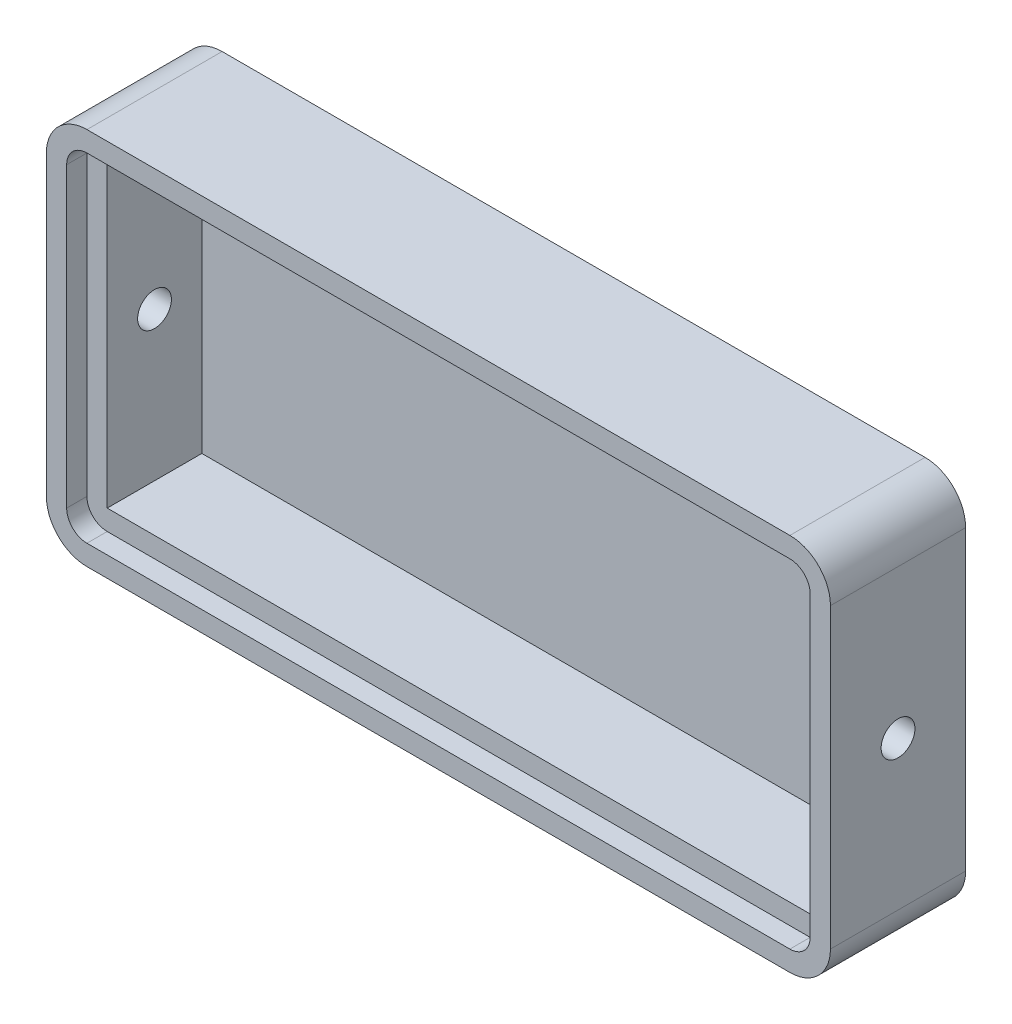
ISO-10303-21;
HEADER;
FILE_DESCRIPTION(('STEP AP214'),'2;1');
FILE_NAME('part.step','',(''),(''),'','','');
FILE_SCHEMA(('AUTOMOTIVE_DESIGN { 1 0 10303 214 1 1 1 1 }'));
ENDSEC;
DATA;
#1=APPLICATION_CONTEXT('core data for automotive mechanical design processes');
#2=APPLICATION_PROTOCOL_DEFINITION('international standard','automotive_design',2000,#1);
#3=PRODUCT_CONTEXT('',#1,'mechanical');
#4=PRODUCT('Part','Part','',(#3));
#5=PRODUCT_RELATED_PRODUCT_CATEGORY('part','',(#4));
#6=PRODUCT_DEFINITION_FORMATION('','',#4);
#7=PRODUCT_DEFINITION_CONTEXT('part definition',#1,'design');
#8=PRODUCT_DEFINITION('design','',#6,#7);
#9=PRODUCT_DEFINITION_SHAPE('','',#8);
#10=(LENGTH_UNIT() NAMED_UNIT(*) SI_UNIT(.MILLI.,.METRE.));
#11=(NAMED_UNIT(*) PLANE_ANGLE_UNIT() SI_UNIT($,.RADIAN.));
#12=(NAMED_UNIT(*) SI_UNIT($,.STERADIAN.) SOLID_ANGLE_UNIT());
#13=UNCERTAINTY_MEASURE_WITH_UNIT(LENGTH_MEASURE(1.E-05),#10,'distance_accuracy_value','');
#14=(GEOMETRIC_REPRESENTATION_CONTEXT(3) GLOBAL_UNCERTAINTY_ASSIGNED_CONTEXT((#13)) GLOBAL_UNIT_ASSIGNED_CONTEXT((#10,
#11,#12)) REPRESENTATION_CONTEXT('',''));
#15=CARTESIAN_POINT('',(0.,0.,0.));
#16=DIRECTION('',(0.,0.,1.));
#17=DIRECTION('',(1.,0.,0.));
#18=AXIS2_PLACEMENT_3D('',#15,#16,#17);
#19=CARTESIAN_POINT('',(58.,28.,20.));
#20=DIRECTION('',(-1.,0.,0.));
#21=DIRECTION('',(0.,-1.,0.));
#22=AXIS2_PLACEMENT_3D('',#19,#20,#21);
#23=PLANE('',#22);
#24=CARTESIAN_POINT('',(58.,0.,10.));
#25=DIRECTION('',(-1.,0.,0.));
#26=DIRECTION('',(0.,0.,1.));
#27=AXIS2_PLACEMENT_3D('',#24,#25,#26);
#28=CIRCLE('',#27,2.5);
#29=CARTESIAN_POINT('',(58.,0.,12.5));
#30=VERTEX_POINT('',#29);
#31=EDGE_CURVE('E375',#30,#30,#28,.T.);
#32=ORIENTED_EDGE('',*,*,#31,.T.);
#33=EDGE_LOOP('',(#32));
#34=FACE_BOUND('',#33,.T.);
#35=DIRECTION('',(0.,1.,0.));
#36=VECTOR('',#35,1.);
#37=CARTESIAN_POINT('',(58.,28.,0.));
#38=LINE('',#37,#36);
#39=CARTESIAN_POINT('',(58.,-22.,0.));
#40=VERTEX_POINT('',#39);
#41=CARTESIAN_POINT('',(58.,22.,0.));
#42=VERTEX_POINT('',#41);
#43=EDGE_CURVE('E220',#40,#42,#38,.T.);
#44=ORIENTED_EDGE('',*,*,#43,.T.);
#45=DIRECTION('',(0.,0.,-1.));
#46=VECTOR('',#45,1.);
#47=CARTESIAN_POINT('',(58.,22.,20.));
#48=LINE('',#47,#46);
#49=CARTESIAN_POINT('',(58.,22.,20.));
#50=VERTEX_POINT('',#49);
#51=EDGE_CURVE('E284',#42,#50,#48,.F.);
#52=ORIENTED_EDGE('',*,*,#51,.T.);
#53=DIRECTION('',(0.,1.,0.));
#54=VECTOR('',#53,1.);
#55=CARTESIAN_POINT('',(58.,28.,20.));
#56=LINE('',#55,#54);
#57=CARTESIAN_POINT('',(58.,-22.,20.));
#58=VERTEX_POINT('',#57);
#59=EDGE_CURVE('E245',#58,#50,#56,.T.);
#60=ORIENTED_EDGE('',*,*,#59,.F.);
#61=DIRECTION('',(0.,0.,-1.));
#62=VECTOR('',#61,1.);
#63=CARTESIAN_POINT('',(58.,-22.,20.));
#64=LINE('',#63,#62);
#65=EDGE_CURVE('E281',#58,#40,#64,.T.);
#66=ORIENTED_EDGE('',*,*,#65,.T.);
#67=EDGE_LOOP('',(#44,#52,#60,#66));
#68=FACE_BOUND('',#67,.T.);
#69=ADVANCED_FACE('F35',(#34,#68),#23,.F.);
#70=CARTESIAN_POINT('',(-58.,28.,20.));
#71=DIRECTION('',(0.,-1.,0.));
#72=DIRECTION('',(0.,0.,-1.));
#73=AXIS2_PLACEMENT_3D('',#70,#71,#72);
#74=PLANE('',#73);
#75=DIRECTION('',(-1.,0.,0.));
#76=VECTOR('',#75,1.);
#77=CARTESIAN_POINT('',(-58.,28.,20.));
#78=LINE('',#77,#76);
#79=CARTESIAN_POINT('',(52.,28.,20.));
#80=VERTEX_POINT('',#79);
#81=CARTESIAN_POINT('',(-52.,28.,20.));
#82=VERTEX_POINT('',#81);
#83=EDGE_CURVE('E248',#80,#82,#78,.T.);
#84=ORIENTED_EDGE('',*,*,#83,.F.);
#85=DIRECTION('',(0.,0.,-1.));
#86=VECTOR('',#85,1.);
#87=CARTESIAN_POINT('',(52.,28.,20.));
#88=LINE('',#87,#86);
#89=CARTESIAN_POINT('',(52.,28.,0.));
#90=VERTEX_POINT('',#89);
#91=EDGE_CURVE('E270',#80,#90,#88,.T.);
#92=ORIENTED_EDGE('',*,*,#91,.T.);
#93=DIRECTION('',(-1.,0.,0.));
#94=VECTOR('',#93,1.);
#95=CARTESIAN_POINT('',(-58.,28.,0.));
#96=LINE('',#95,#94);
#97=CARTESIAN_POINT('',(-52.,28.,0.));
#98=VERTEX_POINT('',#97);
#99=EDGE_CURVE('E261',#90,#98,#96,.T.);
#100=ORIENTED_EDGE('',*,*,#99,.T.);
#101=DIRECTION('',(0.,0.,-1.));
#102=VECTOR('',#101,1.);
#103=CARTESIAN_POINT('',(-52.,28.,20.));
#104=LINE('',#103,#102);
#105=EDGE_CURVE('E258',#98,#82,#104,.F.);
#106=ORIENTED_EDGE('',*,*,#105,.T.);
#107=EDGE_LOOP('',(#84,#92,#100,#106));
#108=FACE_BOUND('',#107,.T.);
#109=ADVANCED_FACE('F333',(#108),#74,.F.);
#110=CARTESIAN_POINT('',(-58.,28.,20.));
#111=DIRECTION('',(1.,0.,0.));
#112=DIRECTION('',(0.,0.,-1.));
#113=AXIS2_PLACEMENT_3D('',#110,#111,#112);
#114=PLANE('',#113);
#115=CARTESIAN_POINT('',(-58.,0.,10.));
#116=DIRECTION('',(-1.,0.,0.));
#117=DIRECTION('',(0.,0.,1.));
#118=AXIS2_PLACEMENT_3D('',#115,#116,#117);
#119=CIRCLE('',#118,2.5);
#120=CARTESIAN_POINT('',(-58.,0.,12.5));
#121=VERTEX_POINT('',#120);
#122=EDGE_CURVE('E373',#121,#121,#119,.T.);
#123=ORIENTED_EDGE('',*,*,#122,.F.);
#124=EDGE_LOOP('',(#123));
#125=FACE_BOUND('',#124,.T.);
#126=DIRECTION('',(0.,-1.,0.));
#127=VECTOR('',#126,1.);
#128=CARTESIAN_POINT('',(-58.,28.,20.));
#129=LINE('',#128,#127);
#130=CARTESIAN_POINT('',(-58.,22.,20.));
#131=VERTEX_POINT('',#130);
#132=CARTESIAN_POINT('',(-58.,-22.,20.));
#133=VERTEX_POINT('',#132);
#134=EDGE_CURVE('E252',#131,#133,#129,.T.);
#135=ORIENTED_EDGE('',*,*,#134,.F.);
#136=DIRECTION('',(0.,0.,-1.));
#137=VECTOR('',#136,1.);
#138=CARTESIAN_POINT('',(-58.,22.,20.));
#139=LINE('',#138,#137);
#140=CARTESIAN_POINT('',(-58.,22.,0.));
#141=VERTEX_POINT('',#140);
#142=EDGE_CURVE('E12',#131,#141,#139,.T.);
#143=ORIENTED_EDGE('',*,*,#142,.T.);
#144=DIRECTION('',(0.,-1.,0.));
#145=VECTOR('',#144,1.);
#146=CARTESIAN_POINT('',(-58.,28.,0.));
#147=LINE('',#146,#145);
#148=CARTESIAN_POINT('',(-58.,-22.,0.));
#149=VERTEX_POINT('',#148);
#150=EDGE_CURVE('E264',#141,#149,#147,.T.);
#151=ORIENTED_EDGE('',*,*,#150,.T.);
#152=DIRECTION('',(0.,0.,-1.));
#153=VECTOR('',#152,1.);
#154=CARTESIAN_POINT('',(-58.,-22.,20.));
#155=LINE('',#154,#153);
#156=EDGE_CURVE('E44',#149,#133,#155,.F.);
#157=ORIENTED_EDGE('',*,*,#156,.T.);
#158=EDGE_LOOP('',(#135,#143,#151,#157));
#159=FACE_BOUND('',#158,.T.);
#160=ADVANCED_FACE('F302',(#125,#159),#114,.F.);
#161=CARTESIAN_POINT('',(-58.,-28.,20.));
#162=DIRECTION('',(0.,1.,0.));
#163=DIRECTION('',(0.,0.,1.));
#164=AXIS2_PLACEMENT_3D('',#161,#162,#163);
#165=PLANE('',#164);
#166=DIRECTION('',(1.,0.,0.));
#167=VECTOR('',#166,1.);
#168=CARTESIAN_POINT('',(-58.,-28.,0.));
#169=LINE('',#168,#167);
#170=CARTESIAN_POINT('',(-52.,-28.,0.));
#171=VERTEX_POINT('',#170);
#172=CARTESIAN_POINT('',(52.,-28.,0.));
#173=VERTEX_POINT('',#172);
#174=EDGE_CURVE('E249',#171,#173,#169,.T.);
#175=ORIENTED_EDGE('',*,*,#174,.T.);
#176=DIRECTION('',(0.,0.,-1.));
#177=VECTOR('',#176,1.);
#178=CARTESIAN_POINT('',(52.,-28.,20.));
#179=LINE('',#178,#177);
#180=CARTESIAN_POINT('',(52.,-28.,20.));
#181=VERTEX_POINT('',#180);
#182=EDGE_CURVE('E297',#173,#181,#179,.F.);
#183=ORIENTED_EDGE('',*,*,#182,.T.);
#184=DIRECTION('',(1.,0.,0.));
#185=VECTOR('',#184,1.);
#186=CARTESIAN_POINT('',(-58.,-28.,20.));
#187=LINE('',#186,#185);
#188=CARTESIAN_POINT('',(-52.,-28.,20.));
#189=VERTEX_POINT('',#188);
#190=EDGE_CURVE('E255',#189,#181,#187,.T.);
#191=ORIENTED_EDGE('',*,*,#190,.F.);
#192=DIRECTION('',(0.,0.,-1.));
#193=VECTOR('',#192,1.);
#194=CARTESIAN_POINT('',(-52.,-28.,20.));
#195=LINE('',#194,#193);
#196=EDGE_CURVE('E294',#189,#171,#195,.T.);
#197=ORIENTED_EDGE('',*,*,#196,.T.);
#198=EDGE_LOOP('',(#175,#183,#191,#197));
#199=FACE_BOUND('',#198,.T.);
#200=ADVANCED_FACE('F314',(#199),#165,.F.);
#201=CARTESIAN_POINT('',(0.,0.,20.));
#202=DIRECTION('',(0.,0.,1.));
#203=DIRECTION('',(1.,0.,0.));
#204=AXIS2_PLACEMENT_3D('',#201,#202,#203);
#205=PLANE('',#204);
#206=DIRECTION('',(0.,1.,0.));
#207=VECTOR('',#206,1.);
#208=CARTESIAN_POINT('',(55.,28.,20.));
#209=LINE('',#208,#207);
#210=CARTESIAN_POINT('',(55.,-22.,20.));
#211=VERTEX_POINT('',#210);
#212=CARTESIAN_POINT('',(55.,22.,20.));
#213=VERTEX_POINT('',#212);
#214=EDGE_CURVE('E183',#211,#213,#209,.T.);
#215=ORIENTED_EDGE('',*,*,#214,.F.);
#216=CARTESIAN_POINT('',(52.,-22.,20.));
#217=DIRECTION('',(0.,0.,1.));
#218=DIRECTION('',(1.,0.,0.));
#219=AXIS2_PLACEMENT_3D('',#216,#217,#218);
#220=CIRCLE('',#219,3.);
#221=CARTESIAN_POINT('',(52.,-25.,20.));
#222=VERTEX_POINT('',#221);
#223=EDGE_CURVE('E233',#222,#211,#220,.T.);
#224=ORIENTED_EDGE('',*,*,#223,.F.);
#225=DIRECTION('',(1.,0.,0.));
#226=VECTOR('',#225,1.);
#227=CARTESIAN_POINT('',(-58.,-25.,20.));
#228=LINE('',#227,#226);
#229=CARTESIAN_POINT('',(-52.,-25.,20.));
#230=VERTEX_POINT('',#229);
#231=EDGE_CURVE('E216',#230,#222,#228,.T.);
#232=ORIENTED_EDGE('',*,*,#231,.F.);
#233=CARTESIAN_POINT('',(-52.,-22.,20.));
#234=DIRECTION('',(0.,0.,1.));
#235=DIRECTION('',(1.,0.,0.));
#236=AXIS2_PLACEMENT_3D('',#233,#234,#235);
#237=CIRCLE('',#236,3.);
#238=CARTESIAN_POINT('',(-55.,-22.,20.));
#239=VERTEX_POINT('',#238);
#240=EDGE_CURVE('E207',#239,#230,#237,.T.);
#241=ORIENTED_EDGE('',*,*,#240,.F.);
#242=DIRECTION('',(0.,-1.,0.));
#243=VECTOR('',#242,1.);
#244=CARTESIAN_POINT('',(-55.,28.,20.));
#245=LINE('',#244,#243);
#246=CARTESIAN_POINT('',(-55.,22.,20.));
#247=VERTEX_POINT('',#246);
#248=EDGE_CURVE('E236',#247,#239,#245,.T.);
#249=ORIENTED_EDGE('',*,*,#248,.F.);
#250=CARTESIAN_POINT('',(-52.,22.,20.));
#251=DIRECTION('',(0.,0.,1.));
#252=DIRECTION('',(1.,0.,0.));
#253=AXIS2_PLACEMENT_3D('',#250,#251,#252);
#254=CIRCLE('',#253,3.);
#255=CARTESIAN_POINT('',(-52.,25.,20.));
#256=VERTEX_POINT('',#255);
#257=EDGE_CURVE('E237',#256,#247,#254,.T.);
#258=ORIENTED_EDGE('',*,*,#257,.F.);
#259=DIRECTION('',(-1.,0.,0.));
#260=VECTOR('',#259,1.);
#261=CARTESIAN_POINT('',(-58.,25.,20.));
#262=LINE('',#261,#260);
#263=CARTESIAN_POINT('',(52.,25.,20.));
#264=VERTEX_POINT('',#263);
#265=EDGE_CURVE('E231',#264,#256,#262,.T.);
#266=ORIENTED_EDGE('',*,*,#265,.F.);
#267=CARTESIAN_POINT('',(52.,22.,20.));
#268=DIRECTION('',(0.,0.,1.));
#269=DIRECTION('',(1.,0.,0.));
#270=AXIS2_PLACEMENT_3D('',#267,#268,#269);
#271=CIRCLE('',#270,3.);
#272=EDGE_CURVE('E227',#213,#264,#271,.T.);
#273=ORIENTED_EDGE('',*,*,#272,.F.);
#274=EDGE_LOOP('',(#215,#224,#232,#241,#249,#258,#266,#273));
#275=FACE_BOUND('',#274,.T.);
#276=ORIENTED_EDGE('',*,*,#59,.T.);
#277=CARTESIAN_POINT('',(52.,22.,20.));
#278=DIRECTION('',(0.,0.,1.));
#279=DIRECTION('',(1.,0.,0.));
#280=AXIS2_PLACEMENT_3D('',#277,#278,#279);
#281=CIRCLE('',#280,6.);
#282=EDGE_CURVE('E292',#50,#80,#281,.T.);
#283=ORIENTED_EDGE('',*,*,#282,.T.);
#284=ORIENTED_EDGE('',*,*,#83,.T.);
#285=CARTESIAN_POINT('',(-52.,22.,20.));
#286=DIRECTION('',(0.,0.,1.));
#287=DIRECTION('',(1.,0.,0.));
#288=AXIS2_PLACEMENT_3D('',#285,#286,#287);
#289=CIRCLE('',#288,6.);
#290=EDGE_CURVE('E288',#82,#131,#289,.T.);
#291=ORIENTED_EDGE('',*,*,#290,.T.);
#292=ORIENTED_EDGE('',*,*,#134,.T.);
#293=CARTESIAN_POINT('',(-52.,-22.,20.));
#294=DIRECTION('',(0.,0.,1.));
#295=DIRECTION('',(1.,0.,0.));
#296=AXIS2_PLACEMENT_3D('',#293,#294,#295);
#297=CIRCLE('',#296,6.);
#298=EDGE_CURVE('E286',#133,#189,#297,.T.);
#299=ORIENTED_EDGE('',*,*,#298,.T.);
#300=ORIENTED_EDGE('',*,*,#190,.T.);
#301=CARTESIAN_POINT('',(52.,-22.,20.));
#302=DIRECTION('',(0.,0.,1.));
#303=DIRECTION('',(1.,0.,0.));
#304=AXIS2_PLACEMENT_3D('',#301,#302,#303);
#305=CIRCLE('',#304,6.);
#306=EDGE_CURVE('E290',#181,#58,#305,.T.);
#307=ORIENTED_EDGE('',*,*,#306,.T.);
#308=EDGE_LOOP('',(#276,#283,#284,#291,#292,#299,#300,#307));
#309=FACE_BOUND('',#308,.T.);
#310=ADVANCED_FACE('F308',(#275,#309),#205,.T.);
#311=CARTESIAN_POINT('',(0.,0.,0.));
#312=DIRECTION('',(0.,0.,1.));
#313=DIRECTION('',(1.,0.,0.));
#314=AXIS2_PLACEMENT_3D('',#311,#312,#313);
#315=PLANE('',#314);
#316=ORIENTED_EDGE('',*,*,#99,.F.);
#317=CARTESIAN_POINT('',(52.,22.,0.));
#318=DIRECTION('',(0.,0.,1.));
#319=DIRECTION('',(1.,0.,0.));
#320=AXIS2_PLACEMENT_3D('',#317,#318,#319);
#321=CIRCLE('',#320,6.);
#322=EDGE_CURVE('E279',#90,#42,#321,.F.);
#323=ORIENTED_EDGE('',*,*,#322,.T.);
#324=ORIENTED_EDGE('',*,*,#43,.F.);
#325=CARTESIAN_POINT('',(52.,-22.,0.));
#326=DIRECTION('',(0.,0.,1.));
#327=DIRECTION('',(1.,0.,0.));
#328=AXIS2_PLACEMENT_3D('',#325,#326,#327);
#329=CIRCLE('',#328,6.);
#330=EDGE_CURVE('E277',#40,#173,#329,.F.);
#331=ORIENTED_EDGE('',*,*,#330,.T.);
#332=ORIENTED_EDGE('',*,*,#174,.F.);
#333=CARTESIAN_POINT('',(-52.,-22.,0.));
#334=DIRECTION('',(0.,0.,1.));
#335=DIRECTION('',(1.,0.,0.));
#336=AXIS2_PLACEMENT_3D('',#333,#334,#335);
#337=CIRCLE('',#336,6.);
#338=EDGE_CURVE('E273',#171,#149,#337,.F.);
#339=ORIENTED_EDGE('',*,*,#338,.T.);
#340=ORIENTED_EDGE('',*,*,#150,.F.);
#341=CARTESIAN_POINT('',(-52.,22.,0.));
#342=DIRECTION('',(0.,0.,1.));
#343=DIRECTION('',(1.,0.,0.));
#344=AXIS2_PLACEMENT_3D('',#341,#342,#343);
#345=CIRCLE('',#344,6.);
#346=EDGE_CURVE('E275',#141,#98,#345,.F.);
#347=ORIENTED_EDGE('',*,*,#346,.T.);
#348=EDGE_LOOP('',(#316,#323,#324,#331,#332,#339,#340,#347));
#349=FACE_BOUND('',#348,.T.);
#350=ADVANCED_FACE('F318',(#349),#315,.F.);
#351=CARTESIAN_POINT('',(52.,22.,20.));
#352=DIRECTION('',(0.,0.,-1.));
#353=DIRECTION('',(-1.,0.,0.));
#354=AXIS2_PLACEMENT_3D('',#351,#352,#353);
#355=CYLINDRICAL_SURFACE('',#354,6.);
#356=ORIENTED_EDGE('',*,*,#282,.F.);
#357=ORIENTED_EDGE('',*,*,#51,.F.);
#358=ORIENTED_EDGE('',*,*,#322,.F.);
#359=ORIENTED_EDGE('',*,*,#91,.F.);
#360=EDGE_LOOP('',(#356,#357,#358,#359));
#361=FACE_BOUND('',#360,.T.);
#362=ADVANCED_FACE('F331',(#361),#355,.T.);
#363=CARTESIAN_POINT('',(52.,-22.,20.));
#364=DIRECTION('',(0.,0.,-1.));
#365=DIRECTION('',(-1.,0.,0.));
#366=AXIS2_PLACEMENT_3D('',#363,#364,#365);
#367=CYLINDRICAL_SURFACE('',#366,6.);
#368=ORIENTED_EDGE('',*,*,#306,.F.);
#369=ORIENTED_EDGE('',*,*,#182,.F.);
#370=ORIENTED_EDGE('',*,*,#330,.F.);
#371=ORIENTED_EDGE('',*,*,#65,.F.);
#372=EDGE_LOOP('',(#368,#369,#370,#371));
#373=FACE_BOUND('',#372,.T.);
#374=ADVANCED_FACE('F323',(#373),#367,.T.);
#375=CARTESIAN_POINT('',(-52.,22.,20.));
#376=DIRECTION('',(0.,0.,-1.));
#377=DIRECTION('',(-1.,0.,0.));
#378=AXIS2_PLACEMENT_3D('',#375,#376,#377);
#379=CYLINDRICAL_SURFACE('',#378,6.);
#380=ORIENTED_EDGE('',*,*,#290,.F.);
#381=ORIENTED_EDGE('',*,*,#105,.F.);
#382=ORIENTED_EDGE('',*,*,#346,.F.);
#383=ORIENTED_EDGE('',*,*,#142,.F.);
#384=EDGE_LOOP('',(#380,#381,#382,#383));
#385=FACE_BOUND('',#384,.T.);
#386=ADVANCED_FACE('F336',(#385),#379,.T.);
#387=CARTESIAN_POINT('',(-52.,-22.,20.));
#388=DIRECTION('',(0.,0.,-1.));
#389=DIRECTION('',(-1.,0.,0.));
#390=AXIS2_PLACEMENT_3D('',#387,#388,#389);
#391=CYLINDRICAL_SURFACE('',#390,6.);
#392=ORIENTED_EDGE('',*,*,#298,.F.);
#393=ORIENTED_EDGE('',*,*,#156,.F.);
#394=ORIENTED_EDGE('',*,*,#338,.F.);
#395=ORIENTED_EDGE('',*,*,#196,.F.);
#396=EDGE_LOOP('',(#392,#393,#394,#395));
#397=FACE_BOUND('',#396,.T.);
#398=ADVANCED_FACE('F37',(#397),#391,.T.);
#399=CARTESIAN_POINT('',(55.,28.,20.));
#400=DIRECTION('',(-1.,0.,0.));
#401=DIRECTION('',(0.,-1.,0.));
#402=AXIS2_PLACEMENT_3D('',#399,#400,#401);
#403=PLANE('',#402);
#404=DIRECTION('',(0.,1.,0.));
#405=VECTOR('',#404,1.);
#406=CARTESIAN_POINT('',(55.,-22.,17.));
#407=LINE('',#406,#405);
#408=CARTESIAN_POINT('',(55.,-22.,17.));
#409=VERTEX_POINT('',#408);
#410=CARTESIAN_POINT('',(55.,22.,17.));
#411=VERTEX_POINT('',#410);
#412=EDGE_CURVE('E383',#409,#411,#407,.T.);
#413=ORIENTED_EDGE('',*,*,#412,.F.);
#414=DIRECTION('',(0.,0.,1.));
#415=VECTOR('',#414,1.);
#416=CARTESIAN_POINT('',(55.,-22.,20.));
#417=LINE('',#416,#415);
#418=EDGE_CURVE('E208',#211,#409,#417,.F.);
#419=ORIENTED_EDGE('',*,*,#418,.F.);
#420=ORIENTED_EDGE('',*,*,#214,.T.);
#421=DIRECTION('',(0.,0.,1.));
#422=VECTOR('',#421,1.);
#423=CARTESIAN_POINT('',(55.,22.,20.));
#424=LINE('',#423,#422);
#425=EDGE_CURVE('E205',#411,#213,#424,.T.);
#426=ORIENTED_EDGE('',*,*,#425,.F.);
#427=EDGE_LOOP('',(#413,#419,#420,#426));
#428=FACE_BOUND('',#427,.T.);
#429=ADVANCED_FACE('F342',(#428),#403,.T.);
#430=CARTESIAN_POINT('',(-58.,25.,20.));
#431=DIRECTION('',(0.,-1.,0.));
#432=DIRECTION('',(0.,0.,-1.));
#433=AXIS2_PLACEMENT_3D('',#430,#431,#432);
#434=PLANE('',#433);
#435=DIRECTION('',(-1.,0.,0.));
#436=VECTOR('',#435,1.);
#437=CARTESIAN_POINT('',(52.,25.,17.));
#438=LINE('',#437,#436);
#439=CARTESIAN_POINT('',(52.,25.,17.));
#440=VERTEX_POINT('',#439);
#441=CARTESIAN_POINT('',(-52.,25.,17.));
#442=VERTEX_POINT('',#441);
#443=EDGE_CURVE('E395',#440,#442,#438,.T.);
#444=ORIENTED_EDGE('',*,*,#443,.F.);
#445=DIRECTION('',(0.,0.,-1.));
#446=VECTOR('',#445,1.);
#447=CARTESIAN_POINT('',(52.,25.,20.));
#448=LINE('',#447,#446);
#449=EDGE_CURVE('E211',#264,#440,#448,.T.);
#450=ORIENTED_EDGE('',*,*,#449,.F.);
#451=ORIENTED_EDGE('',*,*,#265,.T.);
#452=DIRECTION('',(0.,0.,-1.));
#453=VECTOR('',#452,1.);
#454=CARTESIAN_POINT('',(-52.,25.,20.));
#455=LINE('',#454,#453);
#456=EDGE_CURVE('E214',#442,#256,#455,.F.);
#457=ORIENTED_EDGE('',*,*,#456,.F.);
#458=EDGE_LOOP('',(#444,#450,#451,#457));
#459=FACE_BOUND('',#458,.T.);
#460=ADVANCED_FACE('F423',(#459),#434,.T.);
#461=CARTESIAN_POINT('',(-55.,28.,20.));
#462=DIRECTION('',(1.,0.,0.));
#463=DIRECTION('',(0.,0.,-1.));
#464=AXIS2_PLACEMENT_3D('',#461,#462,#463);
#465=PLANE('',#464);
#466=DIRECTION('',(0.,-1.,0.));
#467=VECTOR('',#466,1.);
#468=CARTESIAN_POINT('',(-55.,22.,17.));
#469=LINE('',#468,#467);
#470=CARTESIAN_POINT('',(-55.,22.,17.));
#471=VERTEX_POINT('',#470);
#472=CARTESIAN_POINT('',(-55.,-22.,17.));
#473=VERTEX_POINT('',#472);
#474=EDGE_CURVE('E391',#471,#473,#469,.T.);
#475=ORIENTED_EDGE('',*,*,#474,.F.);
#476=DIRECTION('',(0.,0.,-1.));
#477=VECTOR('',#476,1.);
#478=CARTESIAN_POINT('',(-55.,22.,20.));
#479=LINE('',#478,#477);
#480=EDGE_CURVE('E217',#247,#471,#479,.T.);
#481=ORIENTED_EDGE('',*,*,#480,.F.);
#482=ORIENTED_EDGE('',*,*,#248,.T.);
#483=DIRECTION('',(0.,0.,-1.));
#484=VECTOR('',#483,1.);
#485=CARTESIAN_POINT('',(-55.,-22.,20.));
#486=LINE('',#485,#484);
#487=EDGE_CURVE('E221',#473,#239,#486,.F.);
#488=ORIENTED_EDGE('',*,*,#487,.F.);
#489=EDGE_LOOP('',(#475,#481,#482,#488));
#490=FACE_BOUND('',#489,.T.);
#491=ADVANCED_FACE('F427',(#490),#465,.T.);
#492=CARTESIAN_POINT('',(-58.,-25.,20.));
#493=DIRECTION('',(0.,1.,0.));
#494=DIRECTION('',(0.,0.,1.));
#495=AXIS2_PLACEMENT_3D('',#492,#493,#494);
#496=PLANE('',#495);
#497=DIRECTION('',(1.,0.,0.));
#498=VECTOR('',#497,1.);
#499=CARTESIAN_POINT('',(-52.,-25.,17.));
#500=LINE('',#499,#498);
#501=CARTESIAN_POINT('',(-52.,-25.,17.));
#502=VERTEX_POINT('',#501);
#503=CARTESIAN_POINT('',(52.,-25.,17.));
#504=VERTEX_POINT('',#503);
#505=EDGE_CURVE('E387',#502,#504,#500,.T.);
#506=ORIENTED_EDGE('',*,*,#505,.F.);
#507=DIRECTION('',(0.,0.,1.));
#508=VECTOR('',#507,1.);
#509=CARTESIAN_POINT('',(-52.,-25.,20.));
#510=LINE('',#509,#508);
#511=EDGE_CURVE('E224',#230,#502,#510,.F.);
#512=ORIENTED_EDGE('',*,*,#511,.F.);
#513=ORIENTED_EDGE('',*,*,#231,.T.);
#514=DIRECTION('',(0.,0.,1.));
#515=VECTOR('',#514,1.);
#516=CARTESIAN_POINT('',(52.,-25.,20.));
#517=LINE('',#516,#515);
#518=EDGE_CURVE('E223',#504,#222,#517,.T.);
#519=ORIENTED_EDGE('',*,*,#518,.F.);
#520=EDGE_LOOP('',(#506,#512,#513,#519));
#521=FACE_BOUND('',#520,.T.);
#522=ADVANCED_FACE('F431',(#521),#496,.T.);
#523=CARTESIAN_POINT('',(52.,22.,20.));
#524=DIRECTION('',(0.,0.,-1.));
#525=DIRECTION('',(-1.,0.,0.));
#526=AXIS2_PLACEMENT_3D('',#523,#524,#525);
#527=CYLINDRICAL_SURFACE('',#526,3.);
#528=ORIENTED_EDGE('',*,*,#449,.T.);
#529=CARTESIAN_POINT('',(52.,22.,17.));
#530=DIRECTION('',(0.,0.,1.));
#531=DIRECTION('',(1.,0.,0.));
#532=AXIS2_PLACEMENT_3D('',#529,#530,#531);
#533=CIRCLE('',#532,2.99999999999999);
#534=EDGE_CURVE('E397',#411,#440,#533,.T.);
#535=ORIENTED_EDGE('',*,*,#534,.F.);
#536=ORIENTED_EDGE('',*,*,#425,.T.);
#537=ORIENTED_EDGE('',*,*,#272,.T.);
#538=EDGE_LOOP('',(#528,#535,#536,#537));
#539=FACE_BOUND('',#538,.T.);
#540=ADVANCED_FACE('F435',(#539),#527,.F.);
#541=CARTESIAN_POINT('',(52.,-22.,20.));
#542=DIRECTION('',(0.,0.,-1.));
#543=DIRECTION('',(-1.,0.,0.));
#544=AXIS2_PLACEMENT_3D('',#541,#542,#543);
#545=CYLINDRICAL_SURFACE('',#544,3.);
#546=ORIENTED_EDGE('',*,*,#418,.T.);
#547=CARTESIAN_POINT('',(52.,-22.,17.));
#548=DIRECTION('',(0.,0.,1.));
#549=DIRECTION('',(1.,0.,0.));
#550=AXIS2_PLACEMENT_3D('',#547,#548,#549);
#551=CIRCLE('',#550,3.);
#552=EDGE_CURVE('E385',#504,#409,#551,.T.);
#553=ORIENTED_EDGE('',*,*,#552,.F.);
#554=ORIENTED_EDGE('',*,*,#518,.T.);
#555=ORIENTED_EDGE('',*,*,#223,.T.);
#556=EDGE_LOOP('',(#546,#553,#554,#555));
#557=FACE_BOUND('',#556,.T.);
#558=ADVANCED_FACE('F442',(#557),#545,.F.);
#559=CARTESIAN_POINT('',(-52.,22.,20.));
#560=DIRECTION('',(0.,0.,-1.));
#561=DIRECTION('',(-1.,0.,0.));
#562=AXIS2_PLACEMENT_3D('',#559,#560,#561);
#563=CYLINDRICAL_SURFACE('',#562,3.);
#564=ORIENTED_EDGE('',*,*,#480,.T.);
#565=CARTESIAN_POINT('',(-52.,22.,17.));
#566=DIRECTION('',(0.,0.,1.));
#567=DIRECTION('',(1.,0.,0.));
#568=AXIS2_PLACEMENT_3D('',#565,#566,#567);
#569=CIRCLE('',#568,3.);
#570=EDGE_CURVE('E393',#442,#471,#569,.T.);
#571=ORIENTED_EDGE('',*,*,#570,.F.);
#572=ORIENTED_EDGE('',*,*,#456,.T.);
#573=ORIENTED_EDGE('',*,*,#257,.T.);
#574=EDGE_LOOP('',(#564,#571,#572,#573));
#575=FACE_BOUND('',#574,.T.);
#576=ADVANCED_FACE('F446',(#575),#563,.F.);
#577=CARTESIAN_POINT('',(-52.,-22.,20.));
#578=DIRECTION('',(0.,0.,-1.));
#579=DIRECTION('',(-1.,0.,0.));
#580=AXIS2_PLACEMENT_3D('',#577,#578,#579);
#581=CYLINDRICAL_SURFACE('',#580,3.);
#582=ORIENTED_EDGE('',*,*,#511,.T.);
#583=CARTESIAN_POINT('',(-52.,-22.,17.));
#584=DIRECTION('',(0.,0.,1.));
#585=DIRECTION('',(1.,0.,0.));
#586=AXIS2_PLACEMENT_3D('',#583,#584,#585);
#587=CIRCLE('',#586,3.);
#588=EDGE_CURVE('E389',#473,#502,#587,.T.);
#589=ORIENTED_EDGE('',*,*,#588,.F.);
#590=ORIENTED_EDGE('',*,*,#487,.T.);
#591=ORIENTED_EDGE('',*,*,#240,.T.);
#592=EDGE_LOOP('',(#582,#589,#590,#591));
#593=FACE_BOUND('',#592,.T.);
#594=ADVANCED_FACE('F449',(#593),#581,.F.);
#595=CARTESIAN_POINT('',(-52.,-22.,140.830459735946));
#596=DIRECTION('',(0.,1.,0.));
#597=DIRECTION('',(-1.,0.,0.));
#598=AXIS2_PLACEMENT_3D('',#595,#596,#597);
#599=PLANE('',#598);
#600=DIRECTION('',(0.,0.,-1.));
#601=VECTOR('',#600,1.);
#602=CARTESIAN_POINT('',(-52.,-22.,140.830459735946));
#603=LINE('',#602,#601);
#604=CARTESIAN_POINT('',(-52.,-22.,17.));
#605=VERTEX_POINT('',#604);
#606=CARTESIAN_POINT('',(-52.,-22.,3.));
#607=VERTEX_POINT('',#606);
#608=EDGE_CURVE('E188',#605,#607,#603,.T.);
#609=ORIENTED_EDGE('',*,*,#608,.F.);
#610=DIRECTION('',(1.,0.,0.));
#611=VECTOR('',#610,1.);
#612=CARTESIAN_POINT('',(-52.,-22.,17.));
#613=LINE('',#612,#611);
#614=CARTESIAN_POINT('',(52.,-22.,17.));
#615=VERTEX_POINT('',#614);
#616=EDGE_CURVE('E171',#605,#615,#613,.T.);
#617=ORIENTED_EDGE('',*,*,#616,.T.);
#618=DIRECTION('',(0.,0.,-1.));
#619=VECTOR('',#618,1.);
#620=CARTESIAN_POINT('',(52.,-22.,140.830459735946));
#621=LINE('',#620,#619);
#622=CARTESIAN_POINT('',(52.,-22.,3.));
#623=VERTEX_POINT('',#622);
#624=EDGE_CURVE('E197',#615,#623,#621,.T.);
#625=ORIENTED_EDGE('',*,*,#624,.T.);
#626=DIRECTION('',(1.,0.,0.));
#627=VECTOR('',#626,1.);
#628=CARTESIAN_POINT('',(-52.,-22.,3.));
#629=LINE('',#628,#627);
#630=EDGE_CURVE('E196',#607,#623,#629,.T.);
#631=ORIENTED_EDGE('',*,*,#630,.F.);
#632=EDGE_LOOP('',(#609,#617,#625,#631));
#633=FACE_BOUND('',#632,.T.);
#634=ADVANCED_FACE('F195',(#633),#599,.T.);
#635=CARTESIAN_POINT('',(-52.,22.,140.830459735946));
#636=DIRECTION('',(1.,0.,0.));
#637=DIRECTION('',(0.,0.,-1.));
#638=AXIS2_PLACEMENT_3D('',#635,#636,#637);
#639=PLANE('',#638);
#640=CARTESIAN_POINT('',(-52.,0.,10.));
#641=DIRECTION('',(1.,0.,0.));
#642=DIRECTION('',(0.,0.,-1.));
#643=AXIS2_PLACEMENT_3D('',#640,#641,#642);
#644=CIRCLE('',#643,2.5);
#645=CARTESIAN_POINT('',(-52.,0.,7.5));
#646=VERTEX_POINT('',#645);
#647=EDGE_CURVE('E193',#646,#646,#644,.T.);
#648=ORIENTED_EDGE('',*,*,#647,.F.);
#649=EDGE_LOOP('',(#648));
#650=FACE_BOUND('',#649,.T.);
#651=DIRECTION('',(0.,0.,-1.));
#652=VECTOR('',#651,1.);
#653=CARTESIAN_POINT('',(-52.,22.,140.830459735946));
#654=LINE('',#653,#652);
#655=CARTESIAN_POINT('',(-52.,22.,17.));
#656=VERTEX_POINT('',#655);
#657=CARTESIAN_POINT('',(-52.,22.,3.));
#658=VERTEX_POINT('',#657);
#659=EDGE_CURVE('E190',#656,#658,#654,.T.);
#660=ORIENTED_EDGE('',*,*,#659,.F.);
#661=DIRECTION('',(0.,-1.,0.));
#662=VECTOR('',#661,1.);
#663=CARTESIAN_POINT('',(-52.,22.,17.));
#664=LINE('',#663,#662);
#665=EDGE_CURVE('E175',#656,#605,#664,.T.);
#666=ORIENTED_EDGE('',*,*,#665,.T.);
#667=ORIENTED_EDGE('',*,*,#608,.T.);
#668=DIRECTION('',(0.,-1.,0.));
#669=VECTOR('',#668,1.);
#670=CARTESIAN_POINT('',(-52.,22.,3.));
#671=LINE('',#670,#669);
#672=EDGE_CURVE('E51',#658,#607,#671,.T.);
#673=ORIENTED_EDGE('',*,*,#672,.F.);
#674=EDGE_LOOP('',(#660,#666,#667,#673));
#675=FACE_BOUND('',#674,.T.);
#676=ADVANCED_FACE('F187',(#650,#675),#639,.T.);
#677=CARTESIAN_POINT('',(52.,22.,140.830459735946));
#678=DIRECTION('',(0.,-1.,0.));
#679=DIRECTION('',(0.,0.,-1.));
#680=AXIS2_PLACEMENT_3D('',#677,#678,#679);
#681=PLANE('',#680);
#682=DIRECTION('',(0.,0.,-1.));
#683=VECTOR('',#682,1.);
#684=CARTESIAN_POINT('',(52.,22.,140.830459735946));
#685=LINE('',#684,#683);
#686=CARTESIAN_POINT('',(52.,22.,17.));
#687=VERTEX_POINT('',#686);
#688=CARTESIAN_POINT('',(52.,22.,3.));
#689=VERTEX_POINT('',#688);
#690=EDGE_CURVE('E184',#687,#689,#685,.T.);
#691=ORIENTED_EDGE('',*,*,#690,.F.);
#692=DIRECTION('',(-1.,0.,0.));
#693=VECTOR('',#692,1.);
#694=CARTESIAN_POINT('',(52.,22.,17.));
#695=LINE('',#694,#693);
#696=EDGE_CURVE('E192',#687,#656,#695,.T.);
#697=ORIENTED_EDGE('',*,*,#696,.T.);
#698=ORIENTED_EDGE('',*,*,#659,.T.);
#699=DIRECTION('',(-1.,0.,0.));
#700=VECTOR('',#699,1.);
#701=CARTESIAN_POINT('',(52.,22.,3.));
#702=LINE('',#701,#700);
#703=EDGE_CURVE('E56',#689,#658,#702,.T.);
#704=ORIENTED_EDGE('',*,*,#703,.F.);
#705=EDGE_LOOP('',(#691,#697,#698,#704));
#706=FACE_BOUND('',#705,.T.);
#707=ADVANCED_FACE('F408',(#706),#681,.T.);
#708=CARTESIAN_POINT('',(52.,-22.,140.830459735946));
#709=DIRECTION('',(-1.,0.,0.));
#710=DIRECTION('',(0.,-1.,0.));
#711=AXIS2_PLACEMENT_3D('',#708,#709,#710);
#712=PLANE('',#711);
#713=CARTESIAN_POINT('',(52.,0.,10.));
#714=DIRECTION('',(-1.,0.,0.));
#715=DIRECTION('',(0.,-1.,0.));
#716=AXIS2_PLACEMENT_3D('',#713,#714,#715);
#717=CIRCLE('',#716,2.5);
#718=CARTESIAN_POINT('',(52.,-2.49999999999999,10.));
#719=VERTEX_POINT('',#718);
#720=EDGE_CURVE('E39',#719,#719,#717,.T.);
#721=ORIENTED_EDGE('',*,*,#720,.F.);
#722=EDGE_LOOP('',(#721));
#723=FACE_BOUND('',#722,.T.);
#724=ORIENTED_EDGE('',*,*,#624,.F.);
#725=DIRECTION('',(0.,1.,0.));
#726=VECTOR('',#725,1.);
#727=CARTESIAN_POINT('',(52.,-22.,17.));
#728=LINE('',#727,#726);
#729=EDGE_CURVE('E178',#615,#687,#728,.T.);
#730=ORIENTED_EDGE('',*,*,#729,.T.);
#731=ORIENTED_EDGE('',*,*,#690,.T.);
#732=DIRECTION('',(0.,1.,0.));
#733=VECTOR('',#732,1.);
#734=CARTESIAN_POINT('',(52.,-22.,3.));
#735=LINE('',#734,#733);
#736=EDGE_CURVE('E399',#623,#689,#735,.T.);
#737=ORIENTED_EDGE('',*,*,#736,.F.);
#738=EDGE_LOOP('',(#724,#730,#731,#737));
#739=FACE_BOUND('',#738,.T.);
#740=ADVANCED_FACE('F405',(#723,#739),#712,.T.);
#741=CARTESIAN_POINT('',(0.,0.,17.));
#742=DIRECTION('',(0.,0.,1.));
#743=DIRECTION('',(1.,0.,0.));
#744=AXIS2_PLACEMENT_3D('',#741,#742,#743);
#745=PLANE('',#744);
#746=ORIENTED_EDGE('',*,*,#729,.F.);
#747=ORIENTED_EDGE('',*,*,#616,.F.);
#748=ORIENTED_EDGE('',*,*,#665,.F.);
#749=ORIENTED_EDGE('',*,*,#696,.F.);
#750=EDGE_LOOP('',(#746,#747,#748,#749));
#751=FACE_BOUND('',#750,.T.);
#752=ORIENTED_EDGE('',*,*,#412,.T.);
#753=ORIENTED_EDGE('',*,*,#534,.T.);
#754=ORIENTED_EDGE('',*,*,#443,.T.);
#755=ORIENTED_EDGE('',*,*,#570,.T.);
#756=ORIENTED_EDGE('',*,*,#474,.T.);
#757=ORIENTED_EDGE('',*,*,#588,.T.);
#758=ORIENTED_EDGE('',*,*,#505,.T.);
#759=ORIENTED_EDGE('',*,*,#552,.T.);
#760=EDGE_LOOP('',(#752,#753,#754,#755,#756,#757,#758,#759));
#761=FACE_BOUND('',#760,.T.);
#762=ADVANCED_FACE('F173',(#751,#761),#745,.T.);
#763=CARTESIAN_POINT('',(0.,0.,3.));
#764=DIRECTION('',(0.,0.,1.));
#765=DIRECTION('',(1.,0.,0.));
#766=AXIS2_PLACEMENT_3D('',#763,#764,#765);
#767=PLANE('',#766);
#768=ORIENTED_EDGE('',*,*,#630,.T.);
#769=ORIENTED_EDGE('',*,*,#736,.T.);
#770=ORIENTED_EDGE('',*,*,#703,.T.);
#771=ORIENTED_EDGE('',*,*,#672,.T.);
#772=EDGE_LOOP('',(#768,#769,#770,#771));
#773=FACE_BOUND('',#772,.T.);
#774=ADVANCED_FACE('F402',(#773),#767,.T.);
#775=CARTESIAN_POINT('',(58.,0.,10.));
#776=DIRECTION('',(-1.,0.,0.));
#777=DIRECTION('',(0.,0.,1.));
#778=AXIS2_PLACEMENT_3D('',#775,#776,#777);
#779=CYLINDRICAL_SURFACE('',#778,2.5);
#780=ORIENTED_EDGE('',*,*,#720,.T.);
#781=EDGE_LOOP('',(#780));
#782=FACE_BOUND('',#781,.T.);
#783=ORIENTED_EDGE('',*,*,#31,.F.);
#784=EDGE_LOOP('',(#783));
#785=FACE_BOUND('',#784,.T.);
#786=ADVANCED_FACE('F439',(#782,#785),#779,.F.);
#787=ORIENTED_EDGE('',*,*,#647,.T.);
#788=EDGE_LOOP('',(#787));
#789=FACE_BOUND('',#788,.T.);
#790=ORIENTED_EDGE('',*,*,#122,.T.);
#791=EDGE_LOOP('',(#790));
#792=FACE_BOUND('',#791,.T.);
#793=ADVANCED_FACE('F486',(#789,#792),#779,.F.);
#794=CLOSED_SHELL('',(#69,#109,#160,#200,#310,#350,#362,#374,#386,#398,#429,#460,#491,#522,#540,
#558,#576,#594,#634,#676,#707,#740,#762,#774,#786,#793));
#795=MANIFOLD_SOLID_BREP('B2',#794);
#796=ADVANCED_BREP_SHAPE_REPRESENTATION('',(#18,#795),#14);
#797=SHAPE_DEFINITION_REPRESENTATION(#9,#796);
ENDSEC;
END-ISO-10303-21;
